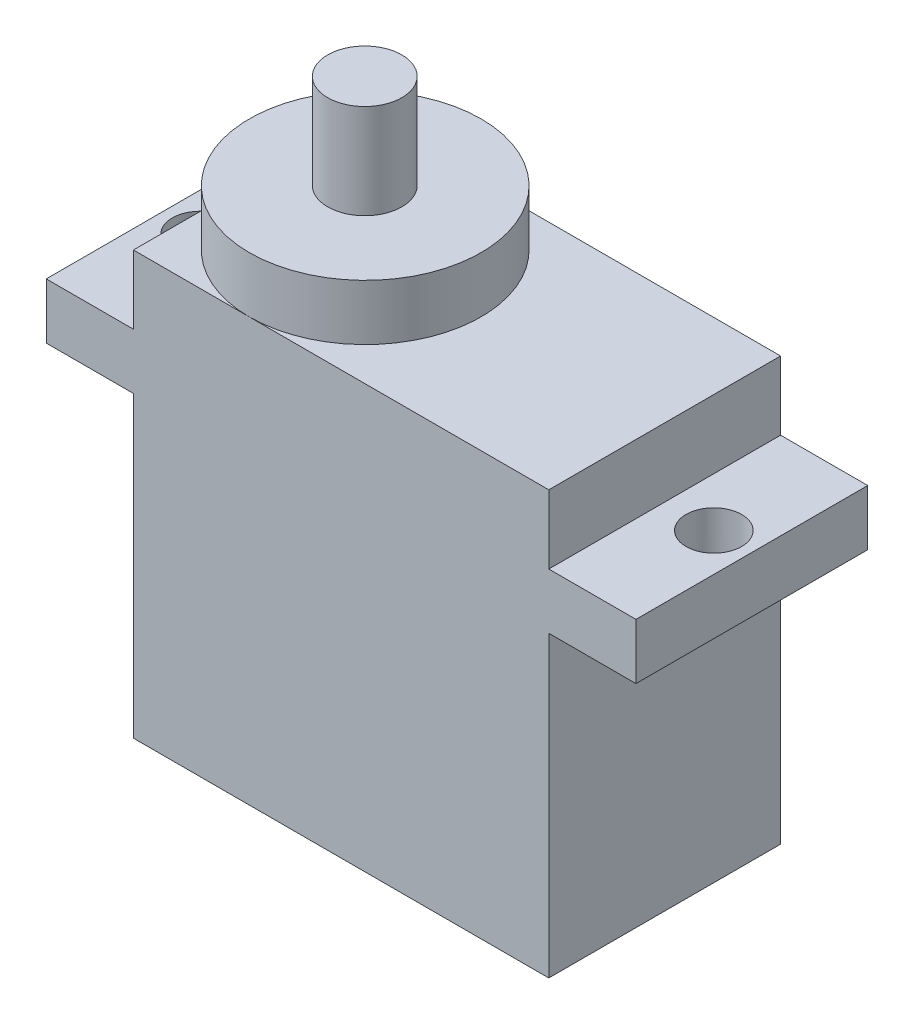
ISO-10303-21;
HEADER;
FILE_DESCRIPTION(('STEP AP214'),'2;1');
FILE_NAME('part.step','',(''),(''),'','','');
FILE_SCHEMA(('AUTOMOTIVE_DESIGN { 1 0 10303 214 1 1 1 1 }'));
ENDSEC;
DATA;
#1=APPLICATION_CONTEXT('core data for automotive mechanical design processes');
#2=APPLICATION_PROTOCOL_DEFINITION('international standard','automotive_design',2000,#1);
#3=PRODUCT_CONTEXT('',#1,'mechanical');
#4=PRODUCT('Part','Part','',(#3));
#5=PRODUCT_RELATED_PRODUCT_CATEGORY('part','',(#4));
#6=PRODUCT_DEFINITION_FORMATION('','',#4);
#7=PRODUCT_DEFINITION_CONTEXT('part definition',#1,'design');
#8=PRODUCT_DEFINITION('design','',#6,#7);
#9=PRODUCT_DEFINITION_SHAPE('','',#8);
#10=(LENGTH_UNIT() NAMED_UNIT(*) SI_UNIT(.MILLI.,.METRE.));
#11=(NAMED_UNIT(*) PLANE_ANGLE_UNIT() SI_UNIT($,.RADIAN.));
#12=(NAMED_UNIT(*) SI_UNIT($,.STERADIAN.) SOLID_ANGLE_UNIT());
#13=UNCERTAINTY_MEASURE_WITH_UNIT(LENGTH_MEASURE(1.E-05),#10,'distance_accuracy_value','');
#14=(GEOMETRIC_REPRESENTATION_CONTEXT(3) GLOBAL_UNCERTAINTY_ASSIGNED_CONTEXT((#13)) GLOBAL_UNIT_ASSIGNED_CONTEXT((#10,
#11,#12)) REPRESENTATION_CONTEXT('',''));
#15=CARTESIAN_POINT('',(0.,0.,0.));
#16=DIRECTION('',(0.,0.,1.));
#17=DIRECTION('',(1.,0.,0.));
#18=AXIS2_PLACEMENT_3D('',#15,#16,#17);
#19=CARTESIAN_POINT('',(0.,22.8,0.));
#20=DIRECTION('',(0.,1.,0.));
#21=DIRECTION('',(0.,0.,1.));
#22=AXIS2_PLACEMENT_3D('',#19,#20,#21);
#23=PLANE('',#22);
#24=CARTESIAN_POINT('',(6.25,22.8,6.25000000000001));
#25=DIRECTION('',(0.,1.,0.));
#26=DIRECTION('',(0.,0.,1.));
#27=AXIS2_PLACEMENT_3D('',#24,#25,#26);
#28=CIRCLE('',#27,6.25);
#29=CARTESIAN_POINT('',(6.25,22.8,12.5));
#30=VERTEX_POINT('',#29);
#31=CARTESIAN_POINT('',(6.25000000000001,22.8,0.));
#32=VERTEX_POINT('',#31);
#33=EDGE_CURVE('E160',#30,#32,#28,.T.);
#34=ORIENTED_EDGE('',*,*,#33,.F.);
#35=DIRECTION('',(1.,0.,0.));
#36=VECTOR('',#35,1.);
#37=CARTESIAN_POINT('',(0.,22.8,12.5));
#38=LINE('',#37,#36);
#39=CARTESIAN_POINT('',(22.4,22.8,12.5));
#40=VERTEX_POINT('',#39);
#41=EDGE_CURVE('E148',#30,#40,#38,.T.);
#42=ORIENTED_EDGE('',*,*,#41,.T.);
#43=DIRECTION('',(0.,0.,-1.));
#44=VECTOR('',#43,1.);
#45=CARTESIAN_POINT('',(22.4,22.8,12.5));
#46=LINE('',#45,#44);
#47=CARTESIAN_POINT('',(22.4,22.8,0.));
#48=VERTEX_POINT('',#47);
#49=EDGE_CURVE('E147',#40,#48,#46,.T.);
#50=ORIENTED_EDGE('',*,*,#49,.T.);
#51=DIRECTION('',(-1.,0.,0.));
#52=VECTOR('',#51,1.);
#53=CARTESIAN_POINT('',(22.4,22.8,0.));
#54=LINE('',#53,#52);
#55=EDGE_CURVE('E162',#48,#32,#54,.T.);
#56=ORIENTED_EDGE('',*,*,#55,.T.);
#57=EDGE_LOOP('',(#34,#42,#50,#56));
#58=FACE_BOUND('',#57,.T.);
#59=ADVANCED_FACE('F39',(#58),#23,.T.);
#60=CARTESIAN_POINT('',(0.,22.8,6.25000000000001));
#61=VERTEX_POINT('',#60);
#62=EDGE_CURVE('E49',#32,#61,#28,.T.);
#63=ORIENTED_EDGE('',*,*,#62,.F.);
#64=CARTESIAN_POINT('',(0.,22.8,0.));
#65=VERTEX_POINT('',#64);
#66=EDGE_CURVE('E266',#32,#65,#54,.T.);
#67=ORIENTED_EDGE('',*,*,#66,.T.);
#68=DIRECTION('',(0.,0.,-1.));
#69=VECTOR('',#68,1.);
#70=CARTESIAN_POINT('',(0.,22.8,12.5));
#71=LINE('',#70,#69);
#72=EDGE_CURVE('E269',#61,#65,#71,.T.);
#73=ORIENTED_EDGE('',*,*,#72,.F.);
#74=EDGE_LOOP('',(#63,#67,#73));
#75=FACE_BOUND('',#74,.T.);
#76=ADVANCED_FACE('F354',(#75),#23,.T.);
#77=CARTESIAN_POINT('',(0.,22.8,12.5));
#78=DIRECTION('',(-1.,0.,0.));
#79=DIRECTION('',(0.,0.,1.));
#80=AXIS2_PLACEMENT_3D('',#77,#78,#79);
#81=PLANE('',#80);
#82=DIRECTION('',(0.,-1.,0.));
#83=VECTOR('',#82,1.);
#84=CARTESIAN_POINT('',(0.,22.8,12.5));
#85=LINE('',#84,#83);
#86=CARTESIAN_POINT('',(0.,16.1,12.5));
#87=VERTEX_POINT('',#86);
#88=CARTESIAN_POINT('',(0.,0.,12.5));
#89=VERTEX_POINT('',#88);
#90=EDGE_CURVE('E272',#87,#89,#85,.T.);
#91=ORIENTED_EDGE('',*,*,#90,.F.);
#92=DIRECTION('',(0.,0.,-1.));
#93=VECTOR('',#92,1.);
#94=CARTESIAN_POINT('',(0.,16.1,12.5));
#95=LINE('',#94,#93);
#96=CARTESIAN_POINT('',(0.,16.1,0.));
#97=VERTEX_POINT('',#96);
#98=EDGE_CURVE('E191',#87,#97,#95,.T.);
#99=ORIENTED_EDGE('',*,*,#98,.T.);
#100=DIRECTION('',(0.,-1.,0.));
#101=VECTOR('',#100,1.);
#102=CARTESIAN_POINT('',(0.,22.8,0.));
#103=LINE('',#102,#101);
#104=CARTESIAN_POINT('',(0.,0.,0.));
#105=VERTEX_POINT('',#104);
#106=EDGE_CURVE('E289',#97,#105,#103,.T.);
#107=ORIENTED_EDGE('',*,*,#106,.T.);
#108=DIRECTION('',(0.,0.,-1.));
#109=VECTOR('',#108,1.);
#110=CARTESIAN_POINT('',(0.,0.,12.5));
#111=LINE('',#110,#109);
#112=EDGE_CURVE('E157',#89,#105,#111,.T.);
#113=ORIENTED_EDGE('',*,*,#112,.F.);
#114=EDGE_LOOP('',(#91,#99,#107,#113));
#115=FACE_BOUND('',#114,.T.);
#116=ADVANCED_FACE('F316',(#115),#81,.T.);
#117=CARTESIAN_POINT('',(0.,19.1,0.));
#118=VERTEX_POINT('',#117);
#119=EDGE_CURVE('E290',#65,#118,#103,.T.);
#120=ORIENTED_EDGE('',*,*,#119,.T.);
#121=DIRECTION('',(0.,0.,1.));
#122=VECTOR('',#121,1.);
#123=CARTESIAN_POINT('',(0.,19.1,0.));
#124=LINE('',#123,#122);
#125=CARTESIAN_POINT('',(0.,19.1,12.5));
#126=VERTEX_POINT('',#125);
#127=EDGE_CURVE('E197',#118,#126,#124,.T.);
#128=ORIENTED_EDGE('',*,*,#127,.T.);
#129=CARTESIAN_POINT('',(0.,22.8,12.5));
#130=VERTEX_POINT('',#129);
#131=EDGE_CURVE('E286',#130,#126,#85,.T.);
#132=ORIENTED_EDGE('',*,*,#131,.F.);
#133=EDGE_CURVE('E143',#130,#61,#71,.T.);
#134=ORIENTED_EDGE('',*,*,#133,.T.);
#135=ORIENTED_EDGE('',*,*,#72,.T.);
#136=EDGE_LOOP('',(#120,#128,#132,#134,#135));
#137=FACE_BOUND('',#136,.T.);
#138=ADVANCED_FACE('F375',(#137),#81,.T.);
#139=CARTESIAN_POINT('',(22.4,22.8,12.5));
#140=DIRECTION('',(-1.,0.,0.));
#141=DIRECTION('',(0.,0.,1.));
#142=AXIS2_PLACEMENT_3D('',#139,#140,#141);
#143=PLANE('',#142);
#144=DIRECTION('',(0.,-1.,0.));
#145=VECTOR('',#144,1.);
#146=CARTESIAN_POINT('',(22.4,22.8,0.));
#147=LINE('',#146,#145);
#148=CARTESIAN_POINT('',(22.4,16.1,0.));
#149=VERTEX_POINT('',#148);
#150=CARTESIAN_POINT('',(22.4,0.,0.));
#151=VERTEX_POINT('',#150);
#152=EDGE_CURVE('E293',#149,#151,#147,.T.);
#153=ORIENTED_EDGE('',*,*,#152,.F.);
#154=DIRECTION('',(0.,0.,1.));
#155=VECTOR('',#154,1.);
#156=CARTESIAN_POINT('',(22.4,16.1,0.));
#157=LINE('',#156,#155);
#158=CARTESIAN_POINT('',(22.4,16.1,12.5));
#159=VERTEX_POINT('',#158);
#160=EDGE_CURVE('E219',#149,#159,#157,.T.);
#161=ORIENTED_EDGE('',*,*,#160,.T.);
#162=DIRECTION('',(0.,-1.,0.));
#163=VECTOR('',#162,1.);
#164=CARTESIAN_POINT('',(22.4,22.8,12.5));
#165=LINE('',#164,#163);
#166=CARTESIAN_POINT('',(22.4,0.,12.5));
#167=VERTEX_POINT('',#166);
#168=EDGE_CURVE('E172',#159,#167,#165,.T.);
#169=ORIENTED_EDGE('',*,*,#168,.T.);
#170=DIRECTION('',(0.,0.,-1.));
#171=VECTOR('',#170,1.);
#172=CARTESIAN_POINT('',(22.4,0.,12.5));
#173=LINE('',#172,#171);
#174=EDGE_CURVE('E275',#167,#151,#173,.T.);
#175=ORIENTED_EDGE('',*,*,#174,.T.);
#176=EDGE_LOOP('',(#153,#161,#169,#175));
#177=FACE_BOUND('',#176,.T.);
#178=ADVANCED_FACE('F308',(#177),#143,.F.);
#179=CARTESIAN_POINT('',(0.,22.8,12.5));
#180=DIRECTION('',(0.,0.,-1.));
#181=DIRECTION('',(-1.,0.,0.));
#182=AXIS2_PLACEMENT_3D('',#179,#180,#181);
#183=PLANE('',#182);
#184=DIRECTION('',(1.,0.,0.));
#185=VECTOR('',#184,1.);
#186=CARTESIAN_POINT('',(0.,0.,12.5));
#187=LINE('',#186,#185);
#188=EDGE_CURVE('E255',#89,#167,#187,.T.);
#189=ORIENTED_EDGE('',*,*,#188,.T.);
#190=ORIENTED_EDGE('',*,*,#168,.F.);
#191=DIRECTION('',(-1.,0.,0.));
#192=VECTOR('',#191,1.);
#193=CARTESIAN_POINT('',(27.1,16.1,12.5));
#194=LINE('',#193,#192);
#195=CARTESIAN_POINT('',(27.1,16.1,12.5));
#196=VERTEX_POINT('',#195);
#197=EDGE_CURVE('E245',#196,#159,#194,.T.);
#198=ORIENTED_EDGE('',*,*,#197,.F.);
#199=DIRECTION('',(0.,1.,0.));
#200=VECTOR('',#199,1.);
#201=CARTESIAN_POINT('',(27.1,16.1,12.5));
#202=LINE('',#201,#200);
#203=CARTESIAN_POINT('',(27.1,19.1,12.5));
#204=VERTEX_POINT('',#203);
#205=EDGE_CURVE('E232',#196,#204,#202,.T.);
#206=ORIENTED_EDGE('',*,*,#205,.T.);
#207=DIRECTION('',(-1.,0.,0.));
#208=VECTOR('',#207,1.);
#209=CARTESIAN_POINT('',(27.1,19.1,12.5));
#210=LINE('',#209,#208);
#211=CARTESIAN_POINT('',(22.4,19.1,12.5));
#212=VERTEX_POINT('',#211);
#213=EDGE_CURVE('E259',#204,#212,#210,.T.);
#214=ORIENTED_EDGE('',*,*,#213,.T.);
#215=EDGE_CURVE('E43',#40,#212,#165,.T.);
#216=ORIENTED_EDGE('',*,*,#215,.F.);
#217=ORIENTED_EDGE('',*,*,#41,.F.);
#218=EDGE_CURVE('E139',#130,#30,#38,.T.);
#219=ORIENTED_EDGE('',*,*,#218,.F.);
#220=ORIENTED_EDGE('',*,*,#131,.T.);
#221=DIRECTION('',(1.,0.,0.));
#222=VECTOR('',#221,1.);
#223=CARTESIAN_POINT('',(-4.7,19.1,12.5));
#224=LINE('',#223,#222);
#225=CARTESIAN_POINT('',(-4.7,19.1,12.5));
#226=VERTEX_POINT('',#225);
#227=EDGE_CURVE('E220',#226,#126,#224,.T.);
#228=ORIENTED_EDGE('',*,*,#227,.F.);
#229=DIRECTION('',(0.,-1.,0.));
#230=VECTOR('',#229,1.);
#231=CARTESIAN_POINT('',(-4.7,19.1,12.5));
#232=LINE('',#231,#230);
#233=CARTESIAN_POINT('',(-4.7,16.1,12.5));
#234=VERTEX_POINT('',#233);
#235=EDGE_CURVE('E205',#226,#234,#232,.T.);
#236=ORIENTED_EDGE('',*,*,#235,.T.);
#237=DIRECTION('',(1.,0.,0.));
#238=VECTOR('',#237,1.);
#239=CARTESIAN_POINT('',(-4.7,16.1,12.5));
#240=LINE('',#239,#238);
#241=EDGE_CURVE('E216',#234,#87,#240,.T.);
#242=ORIENTED_EDGE('',*,*,#241,.T.);
#243=ORIENTED_EDGE('',*,*,#90,.T.);
#244=EDGE_LOOP('',(#189,#190,#198,#206,#214,#216,#217,#219,#220,#228,#236,#242,#243));
#245=FACE_BOUND('',#244,.T.);
#246=ADVANCED_FACE('F41',(#245),#183,.F.);
#247=ORIENTED_EDGE('',*,*,#215,.T.);
#248=DIRECTION('',(0.,0.,-1.));
#249=VECTOR('',#248,1.);
#250=CARTESIAN_POINT('',(22.4,19.1,12.5));
#251=LINE('',#250,#249);
#252=CARTESIAN_POINT('',(22.4,19.1,0.));
#253=VERTEX_POINT('',#252);
#254=EDGE_CURVE('E233',#212,#253,#251,.T.);
#255=ORIENTED_EDGE('',*,*,#254,.T.);
#256=EDGE_CURVE('E294',#48,#253,#147,.T.);
#257=ORIENTED_EDGE('',*,*,#256,.F.);
#258=ORIENTED_EDGE('',*,*,#49,.F.);
#259=EDGE_LOOP('',(#247,#255,#257,#258));
#260=FACE_BOUND('',#259,.T.);
#261=ADVANCED_FACE('F367',(#260),#143,.F.);
#262=CARTESIAN_POINT('',(22.4,22.8,0.));
#263=DIRECTION('',(0.,0.,1.));
#264=DIRECTION('',(1.,0.,0.));
#265=AXIS2_PLACEMENT_3D('',#262,#263,#264);
#266=PLANE('',#265);
#267=DIRECTION('',(-1.,0.,0.));
#268=VECTOR('',#267,1.);
#269=CARTESIAN_POINT('',(22.4,0.,0.));
#270=LINE('',#269,#268);
#271=EDGE_CURVE('E279',#151,#105,#270,.T.);
#272=ORIENTED_EDGE('',*,*,#271,.T.);
#273=ORIENTED_EDGE('',*,*,#106,.F.);
#274=DIRECTION('',(1.,0.,0.));
#275=VECTOR('',#274,1.);
#276=CARTESIAN_POINT('',(-4.7,16.1,0.));
#277=LINE('',#276,#275);
#278=CARTESIAN_POINT('',(-4.7,16.1,0.));
#279=VERTEX_POINT('',#278);
#280=EDGE_CURVE('E209',#279,#97,#277,.T.);
#281=ORIENTED_EDGE('',*,*,#280,.F.);
#282=DIRECTION('',(0.,1.,0.));
#283=VECTOR('',#282,1.);
#284=CARTESIAN_POINT('',(-4.7,16.1,0.));
#285=LINE('',#284,#283);
#286=CARTESIAN_POINT('',(-4.7,19.1,0.));
#287=VERTEX_POINT('',#286);
#288=EDGE_CURVE('E196',#279,#287,#285,.T.);
#289=ORIENTED_EDGE('',*,*,#288,.T.);
#290=DIRECTION('',(1.,0.,0.));
#291=VECTOR('',#290,1.);
#292=CARTESIAN_POINT('',(-4.7,19.1,0.));
#293=LINE('',#292,#291);
#294=EDGE_CURVE('E223',#287,#118,#293,.T.);
#295=ORIENTED_EDGE('',*,*,#294,.T.);
#296=ORIENTED_EDGE('',*,*,#119,.F.);
#297=ORIENTED_EDGE('',*,*,#66,.F.);
#298=ORIENTED_EDGE('',*,*,#55,.F.);
#299=ORIENTED_EDGE('',*,*,#256,.T.);
#300=DIRECTION('',(-1.,0.,0.));
#301=VECTOR('',#300,1.);
#302=CARTESIAN_POINT('',(27.1,19.1,0.));
#303=LINE('',#302,#301);
#304=CARTESIAN_POINT('',(27.1,19.1,0.));
#305=VERTEX_POINT('',#304);
#306=EDGE_CURVE('E256',#305,#253,#303,.T.);
#307=ORIENTED_EDGE('',*,*,#306,.F.);
#308=DIRECTION('',(0.,-1.,0.));
#309=VECTOR('',#308,1.);
#310=CARTESIAN_POINT('',(27.1,19.1,0.));
#311=LINE('',#310,#309);
#312=CARTESIAN_POINT('',(27.1,16.1,0.));
#313=VERTEX_POINT('',#312);
#314=EDGE_CURVE('E241',#305,#313,#311,.T.);
#315=ORIENTED_EDGE('',*,*,#314,.T.);
#316=DIRECTION('',(-1.,0.,0.));
#317=VECTOR('',#316,1.);
#318=CARTESIAN_POINT('',(27.1,16.1,0.));
#319=LINE('',#318,#317);
#320=EDGE_CURVE('E252',#313,#149,#319,.T.);
#321=ORIENTED_EDGE('',*,*,#320,.T.);
#322=ORIENTED_EDGE('',*,*,#152,.T.);
#323=EDGE_LOOP('',(#272,#273,#281,#289,#295,#296,#297,#298,#299,#307,#315,#321,#322));
#324=FACE_BOUND('',#323,.T.);
#325=ADVANCED_FACE('F302',(#324),#266,.F.);
#326=EDGE_CURVE('E57',#61,#30,#28,.T.);
#327=ORIENTED_EDGE('',*,*,#326,.F.);
#328=ORIENTED_EDGE('',*,*,#133,.F.);
#329=ORIENTED_EDGE('',*,*,#218,.T.);
#330=EDGE_LOOP('',(#327,#328,#329));
#331=FACE_BOUND('',#330,.T.);
#332=ADVANCED_FACE('F141',(#331),#23,.T.);
#333=CARTESIAN_POINT('',(0.,0.,0.));
#334=DIRECTION('',(0.,1.,0.));
#335=DIRECTION('',(0.,0.,1.));
#336=AXIS2_PLACEMENT_3D('',#333,#334,#335);
#337=PLANE('',#336);
#338=ORIENTED_EDGE('',*,*,#188,.F.);
#339=ORIENTED_EDGE('',*,*,#112,.T.);
#340=ORIENTED_EDGE('',*,*,#271,.F.);
#341=ORIENTED_EDGE('',*,*,#174,.F.);
#342=EDGE_LOOP('',(#338,#339,#340,#341));
#343=FACE_BOUND('',#342,.T.);
#344=ADVANCED_FACE('F312',(#343),#337,.F.);
#345=CARTESIAN_POINT('',(27.1,16.1,0.));
#346=DIRECTION('',(0.,-1.,0.));
#347=DIRECTION('',(0.,0.,-1.));
#348=AXIS2_PLACEMENT_3D('',#345,#346,#347);
#349=PLANE('',#348);
#350=CARTESIAN_POINT('',(25.05,16.1,6.25));
#351=DIRECTION('',(0.,-1.,0.));
#352=DIRECTION('',(0.,0.,-1.));
#353=AXIS2_PLACEMENT_3D('',#350,#351,#352);
#354=CIRCLE('',#353,1.5);
#355=CARTESIAN_POINT('',(25.05,16.1,4.75));
#356=VERTEX_POINT('',#355);
#357=EDGE_CURVE('E187',#356,#356,#354,.T.);
#358=ORIENTED_EDGE('',*,*,#357,.F.);
#359=EDGE_LOOP('',(#358));
#360=FACE_BOUND('',#359,.T.);
#361=ORIENTED_EDGE('',*,*,#160,.F.);
#362=ORIENTED_EDGE('',*,*,#320,.F.);
#363=DIRECTION('',(0.,0.,1.));
#364=VECTOR('',#363,1.);
#365=CARTESIAN_POINT('',(27.1,16.1,0.));
#366=LINE('',#365,#364);
#367=EDGE_CURVE('E228',#313,#196,#366,.T.);
#368=ORIENTED_EDGE('',*,*,#367,.T.);
#369=ORIENTED_EDGE('',*,*,#197,.T.);
#370=EDGE_LOOP('',(#361,#362,#368,#369));
#371=FACE_BOUND('',#370,.T.);
#372=ADVANCED_FACE('F366',(#360,#371),#349,.T.);
#373=CARTESIAN_POINT('',(27.1,19.1,12.5));
#374=DIRECTION('',(0.,1.,0.));
#375=DIRECTION('',(0.,0.,1.));
#376=AXIS2_PLACEMENT_3D('',#373,#374,#375);
#377=PLANE('',#376);
#378=CARTESIAN_POINT('',(25.05,19.1,6.25));
#379=DIRECTION('',(0.,1.,0.));
#380=DIRECTION('',(0.,0.,1.));
#381=AXIS2_PLACEMENT_3D('',#378,#379,#380);
#382=CIRCLE('',#381,1.5);
#383=CARTESIAN_POINT('',(25.05,19.1,7.75));
#384=VERTEX_POINT('',#383);
#385=EDGE_CURVE('E180',#384,#384,#382,.T.);
#386=ORIENTED_EDGE('',*,*,#385,.F.);
#387=EDGE_LOOP('',(#386));
#388=FACE_BOUND('',#387,.T.);
#389=ORIENTED_EDGE('',*,*,#254,.F.);
#390=ORIENTED_EDGE('',*,*,#213,.F.);
#391=DIRECTION('',(0.,0.,-1.));
#392=VECTOR('',#391,1.);
#393=CARTESIAN_POINT('',(27.1,19.1,12.5));
#394=LINE('',#393,#392);
#395=EDGE_CURVE('E237',#204,#305,#394,.T.);
#396=ORIENTED_EDGE('',*,*,#395,.T.);
#397=ORIENTED_EDGE('',*,*,#306,.T.);
#398=EDGE_LOOP('',(#389,#390,#396,#397));
#399=FACE_BOUND('',#398,.T.);
#400=ADVANCED_FACE('F405',(#388,#399),#377,.T.);
#401=CARTESIAN_POINT('',(27.1,0.,0.));
#402=DIRECTION('',(-1.,0.,0.));
#403=DIRECTION('',(0.,0.,1.));
#404=AXIS2_PLACEMENT_3D('',#401,#402,#403);
#405=PLANE('',#404);
#406=ORIENTED_EDGE('',*,*,#367,.F.);
#407=ORIENTED_EDGE('',*,*,#314,.F.);
#408=ORIENTED_EDGE('',*,*,#395,.F.);
#409=ORIENTED_EDGE('',*,*,#205,.F.);
#410=EDGE_LOOP('',(#406,#407,#408,#409));
#411=FACE_BOUND('',#410,.T.);
#412=ADVANCED_FACE('F396',(#411),#405,.F.);
#413=CARTESIAN_POINT('',(-4.7,16.1,12.5));
#414=DIRECTION('',(0.,-1.,0.));
#415=DIRECTION('',(0.,0.,-1.));
#416=AXIS2_PLACEMENT_3D('',#413,#414,#415);
#417=PLANE('',#416);
#418=CARTESIAN_POINT('',(-2.65,16.1,6.25000000000001));
#419=DIRECTION('',(0.,-1.,0.));
#420=DIRECTION('',(0.,0.,-1.));
#421=AXIS2_PLACEMENT_3D('',#418,#419,#420);
#422=CIRCLE('',#421,1.5);
#423=CARTESIAN_POINT('',(-2.65,16.1,4.75000000000001));
#424=VERTEX_POINT('',#423);
#425=EDGE_CURVE('E179',#424,#424,#422,.T.);
#426=ORIENTED_EDGE('',*,*,#425,.F.);
#427=EDGE_LOOP('',(#426));
#428=FACE_BOUND('',#427,.T.);
#429=ORIENTED_EDGE('',*,*,#98,.F.);
#430=ORIENTED_EDGE('',*,*,#241,.F.);
#431=DIRECTION('',(0.,0.,-1.));
#432=VECTOR('',#431,1.);
#433=CARTESIAN_POINT('',(-4.7,16.1,12.5));
#434=LINE('',#433,#432);
#435=EDGE_CURVE('E192',#234,#279,#434,.T.);
#436=ORIENTED_EDGE('',*,*,#435,.T.);
#437=ORIENTED_EDGE('',*,*,#280,.T.);
#438=EDGE_LOOP('',(#429,#430,#436,#437));
#439=FACE_BOUND('',#438,.T.);
#440=ADVANCED_FACE('F394',(#428,#439),#417,.T.);
#441=CARTESIAN_POINT('',(-4.7,19.1,0.));
#442=DIRECTION('',(0.,1.,0.));
#443=DIRECTION('',(0.,0.,1.));
#444=AXIS2_PLACEMENT_3D('',#441,#442,#443);
#445=PLANE('',#444);
#446=CARTESIAN_POINT('',(-2.65,19.1,6.25000000000001));
#447=DIRECTION('',(0.,1.,0.));
#448=DIRECTION('',(0.,0.,1.));
#449=AXIS2_PLACEMENT_3D('',#446,#447,#448);
#450=CIRCLE('',#449,1.5);
#451=CARTESIAN_POINT('',(-2.65,19.1,7.75000000000001));
#452=VERTEX_POINT('',#451);
#453=EDGE_CURVE('E175',#452,#452,#450,.T.);
#454=ORIENTED_EDGE('',*,*,#453,.F.);
#455=EDGE_LOOP('',(#454));
#456=FACE_BOUND('',#455,.T.);
#457=ORIENTED_EDGE('',*,*,#127,.F.);
#458=ORIENTED_EDGE('',*,*,#294,.F.);
#459=DIRECTION('',(0.,0.,1.));
#460=VECTOR('',#459,1.);
#461=CARTESIAN_POINT('',(-4.7,19.1,0.));
#462=LINE('',#461,#460);
#463=EDGE_CURVE('E201',#287,#226,#462,.T.);
#464=ORIENTED_EDGE('',*,*,#463,.T.);
#465=ORIENTED_EDGE('',*,*,#227,.T.);
#466=EDGE_LOOP('',(#457,#458,#464,#465));
#467=FACE_BOUND('',#466,.T.);
#468=ADVANCED_FACE('F388',(#456,#467),#445,.T.);
#469=CARTESIAN_POINT('',(-4.7,0.,0.));
#470=DIRECTION('',(1.,0.,0.));
#471=DIRECTION('',(0.,0.,-1.));
#472=AXIS2_PLACEMENT_3D('',#469,#470,#471);
#473=PLANE('',#472);
#474=ORIENTED_EDGE('',*,*,#435,.F.);
#475=ORIENTED_EDGE('',*,*,#235,.F.);
#476=ORIENTED_EDGE('',*,*,#463,.F.);
#477=ORIENTED_EDGE('',*,*,#288,.F.);
#478=EDGE_LOOP('',(#474,#475,#476,#477));
#479=FACE_BOUND('',#478,.T.);
#480=ADVANCED_FACE('F392',(#479),#473,.F.);
#481=CARTESIAN_POINT('',(-2.65,14.4,6.25000000000001));
#482=DIRECTION('',(0.,1.,0.));
#483=DIRECTION('',(0.,0.,1.));
#484=AXIS2_PLACEMENT_3D('',#481,#482,#483);
#485=CYLINDRICAL_SURFACE('',#484,1.5);
#486=ORIENTED_EDGE('',*,*,#425,.T.);
#487=EDGE_LOOP('',(#486));
#488=FACE_BOUND('',#487,.T.);
#489=ORIENTED_EDGE('',*,*,#453,.T.);
#490=EDGE_LOOP('',(#489));
#491=FACE_BOUND('',#490,.T.);
#492=ADVANCED_FACE('F349',(#488,#491),#485,.F.);
#493=CARTESIAN_POINT('',(25.05,14.4,6.25));
#494=DIRECTION('',(0.,1.,0.));
#495=DIRECTION('',(0.,0.,1.));
#496=AXIS2_PLACEMENT_3D('',#493,#494,#495);
#497=CYLINDRICAL_SURFACE('',#496,1.5);
#498=ORIENTED_EDGE('',*,*,#357,.T.);
#499=EDGE_LOOP('',(#498));
#500=FACE_BOUND('',#499,.T.);
#501=ORIENTED_EDGE('',*,*,#385,.T.);
#502=EDGE_LOOP('',(#501));
#503=FACE_BOUND('',#502,.T.);
#504=ADVANCED_FACE('F344',(#500,#503),#497,.F.);
#505=CARTESIAN_POINT('',(6.25,25.8,6.25000000000001));
#506=DIRECTION('',(0.,-1.,0.));
#507=DIRECTION('',(0.,0.,-1.));
#508=AXIS2_PLACEMENT_3D('',#505,#506,#507);
#509=CYLINDRICAL_SURFACE('',#508,6.25);
#510=CARTESIAN_POINT('',(6.25,25.8,6.25000000000001));
#511=DIRECTION('',(0.,1.,0.));
#512=DIRECTION('',(0.,0.,1.));
#513=AXIS2_PLACEMENT_3D('',#510,#511,#512);
#514=CIRCLE('',#513,6.25);
#515=CARTESIAN_POINT('',(6.25,25.8,12.5));
#516=VERTEX_POINT('',#515);
#517=EDGE_CURVE('E165',#516,#516,#514,.T.);
#518=ORIENTED_EDGE('',*,*,#517,.F.);
#519=EDGE_LOOP('',(#518));
#520=FACE_BOUND('',#519,.T.);
#521=ORIENTED_EDGE('',*,*,#33,.T.);
#522=ORIENTED_EDGE('',*,*,#62,.T.);
#523=ORIENTED_EDGE('',*,*,#326,.T.);
#524=EDGE_LOOP('',(#521,#522,#523));
#525=FACE_BOUND('',#524,.T.);
#526=ADVANCED_FACE('F168',(#520,#525),#509,.T.);
#527=CARTESIAN_POINT('',(6.25,25.8,6.25000000000001));
#528=DIRECTION('',(0.,1.,0.));
#529=DIRECTION('',(0.,0.,1.));
#530=AXIS2_PLACEMENT_3D('',#527,#528,#529);
#531=PLANE('',#530);
#532=CARTESIAN_POINT('',(6.22551609180277,25.8,6.25000000000001));
#533=DIRECTION('',(0.,1.,0.));
#534=DIRECTION('',(0.,0.,1.));
#535=AXIS2_PLACEMENT_3D('',#532,#533,#534);
#536=CIRCLE('',#535,2.);
#537=CARTESIAN_POINT('',(6.22551609180277,25.8,8.25000000000001));
#538=VERTEX_POINT('',#537);
#539=EDGE_CURVE('E11',#538,#538,#536,.T.);
#540=ORIENTED_EDGE('',*,*,#539,.F.);
#541=EDGE_LOOP('',(#540));
#542=FACE_BOUND('',#541,.T.);
#543=ORIENTED_EDGE('',*,*,#517,.T.);
#544=EDGE_LOOP('',(#543));
#545=FACE_BOUND('',#544,.T.);
#546=ADVANCED_FACE('F334',(#542,#545),#531,.T.);
#547=CARTESIAN_POINT('',(6.22551609180277,30.9,6.25000000000001));
#548=DIRECTION('',(0.,-1.,0.));
#549=DIRECTION('',(0.,0.,-1.));
#550=AXIS2_PLACEMENT_3D('',#547,#548,#549);
#551=CYLINDRICAL_SURFACE('',#550,2.);
#552=CARTESIAN_POINT('',(6.22551609180277,30.9,6.25000000000001));
#553=DIRECTION('',(0.,1.,0.));
#554=DIRECTION('',(0.,0.,1.));
#555=AXIS2_PLACEMENT_3D('',#552,#553,#554);
#556=CIRCLE('',#555,2.);
#557=CARTESIAN_POINT('',(6.22551609180277,30.9,8.25000000000001));
#558=VERTEX_POINT('',#557);
#559=EDGE_CURVE('E166',#558,#558,#556,.T.);
#560=ORIENTED_EDGE('',*,*,#559,.F.);
#561=EDGE_LOOP('',(#560));
#562=FACE_BOUND('',#561,.T.);
#563=ORIENTED_EDGE('',*,*,#539,.T.);
#564=EDGE_LOOP('',(#563));
#565=FACE_BOUND('',#564,.T.);
#566=ADVANCED_FACE('F331',(#562,#565),#551,.T.);
#567=CARTESIAN_POINT('',(6.22551609180277,30.9,6.25000000000001));
#568=DIRECTION('',(0.,1.,0.));
#569=DIRECTION('',(0.,0.,1.));
#570=AXIS2_PLACEMENT_3D('',#567,#568,#569);
#571=PLANE('',#570);
#572=ORIENTED_EDGE('',*,*,#559,.T.);
#573=EDGE_LOOP('',(#572));
#574=FACE_BOUND('',#573,.T.);
#575=ADVANCED_FACE('F329',(#574),#571,.T.);
#576=CLOSED_SHELL('',(#59,#76,#116,#138,#178,#246,#261,#325,#332,#344,#372,#400,#412,#440,#468,
#480,#492,#504,#526,#546,#566,#575));
#577=MANIFOLD_SOLID_BREP('B2',#576);
#578=ADVANCED_BREP_SHAPE_REPRESENTATION('',(#18,#577),#14);
#579=SHAPE_DEFINITION_REPRESENTATION(#9,#578);
ENDSEC;
END-ISO-10303-21;
